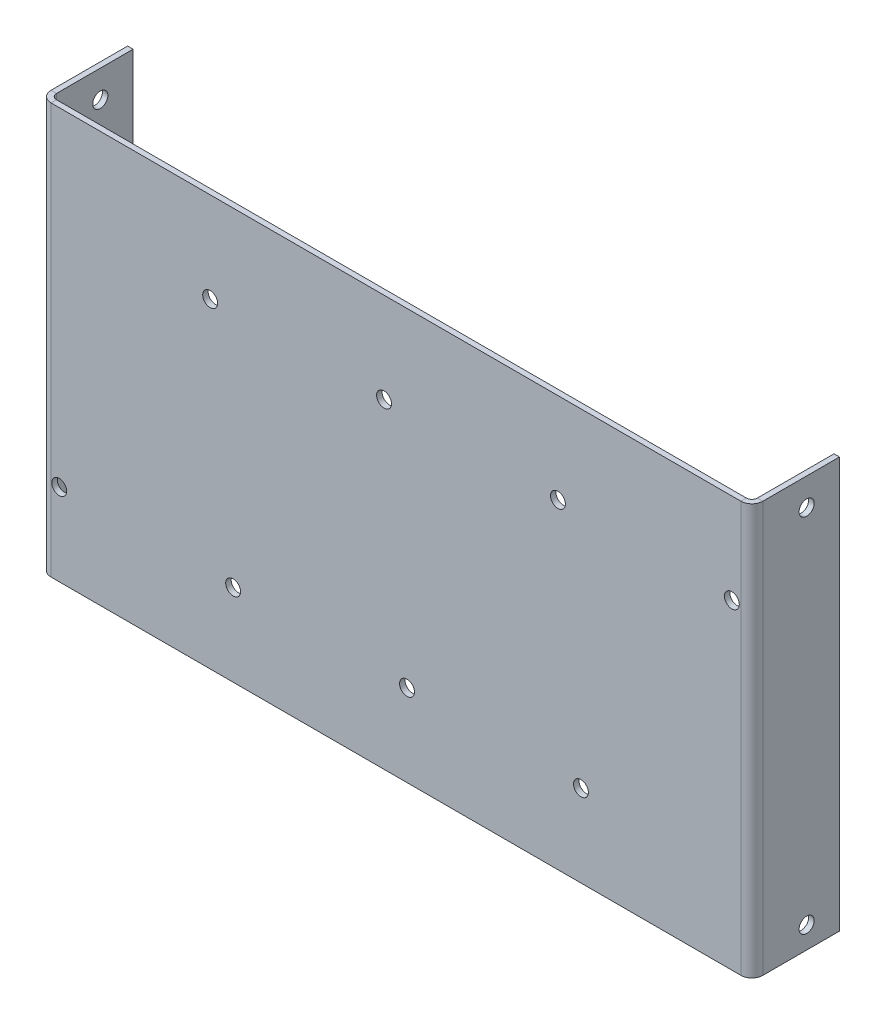
ISO-10303-21;
HEADER;
FILE_DESCRIPTION(('STEP AP214'),'2;1');
FILE_NAME('part.step','',(''),(''),'','','');
FILE_SCHEMA(('AUTOMOTIVE_DESIGN { 1 0 10303 214 1 1 1 1 }'));
ENDSEC;
DATA;
#1=APPLICATION_CONTEXT('core data for automotive mechanical design processes');
#2=APPLICATION_PROTOCOL_DEFINITION('international standard','automotive_design',2000,#1);
#3=PRODUCT_CONTEXT('',#1,'mechanical');
#4=PRODUCT('Part','Part','',(#3));
#5=PRODUCT_RELATED_PRODUCT_CATEGORY('part','',(#4));
#6=PRODUCT_DEFINITION_FORMATION('','',#4);
#7=PRODUCT_DEFINITION_CONTEXT('part definition',#1,'design');
#8=PRODUCT_DEFINITION('design','',#6,#7);
#9=PRODUCT_DEFINITION_SHAPE('','',#8);
#10=(LENGTH_UNIT() NAMED_UNIT(*) SI_UNIT(.MILLI.,.METRE.));
#11=(NAMED_UNIT(*) PLANE_ANGLE_UNIT() SI_UNIT($,.RADIAN.));
#12=(NAMED_UNIT(*) SI_UNIT($,.STERADIAN.) SOLID_ANGLE_UNIT());
#13=UNCERTAINTY_MEASURE_WITH_UNIT(LENGTH_MEASURE(1.E-05),#10,'distance_accuracy_value','');
#14=(GEOMETRIC_REPRESENTATION_CONTEXT(3) GLOBAL_UNCERTAINTY_ASSIGNED_CONTEXT((#13)) GLOBAL_UNIT_ASSIGNED_CONTEXT((#10,
#11,#12)) REPRESENTATION_CONTEXT('',''));
#15=CARTESIAN_POINT('',(0.,0.,0.));
#16=DIRECTION('',(0.,0.,1.));
#17=DIRECTION('',(1.,0.,0.));
#18=AXIS2_PLACEMENT_3D('',#15,#16,#17);
#19=CARTESIAN_POINT('',(-168.275,130.747339992382,0.));
#20=DIRECTION('',(0.,1.,0.));
#21=DIRECTION('',(-1.,0.,0.));
#22=AXIS2_PLACEMENT_3D('',#19,#20,#21);
#23=PLANE('',#22);
#24=DIRECTION('',(0.,0.,-1.));
#25=VECTOR('',#24,1.);
#26=CARTESIAN_POINT('',(-165.735,130.747339992382,0.));
#27=LINE('',#26,#25);
#28=CARTESIAN_POINT('',(-165.735,130.747339992382,1.27));
#29=VERTEX_POINT('',#28);
#30=CARTESIAN_POINT('',(-165.735,130.747339992382,0.));
#31=VERTEX_POINT('',#30);
#32=EDGE_CURVE('E11',#29,#31,#27,.T.);
#33=ORIENTED_EDGE('',*,*,#32,.F.);
#34=DIRECTION('',(1.,0.,0.));
#35=VECTOR('',#34,1.);
#36=CARTESIAN_POINT('',(0.,130.747339992382,1.27));
#37=LINE('',#36,#35);
#38=CARTESIAN_POINT('',(-5.715,130.747339992382,1.27));
#39=VERTEX_POINT('',#38);
#40=EDGE_CURVE('E149',#39,#29,#37,.F.);
#41=ORIENTED_EDGE('',*,*,#40,.F.);
#42=DIRECTION('',(0.,0.,-1.));
#43=VECTOR('',#42,1.);
#44=CARTESIAN_POINT('',(-5.715,130.747339992382,0.));
#45=LINE('',#44,#43);
#46=CARTESIAN_POINT('',(-5.715,130.747339992382,0.));
#47=VERTEX_POINT('',#46);
#48=EDGE_CURVE('E49',#39,#47,#45,.T.);
#49=ORIENTED_EDGE('',*,*,#48,.T.);
#50=DIRECTION('',(-1.,0.,0.));
#51=VECTOR('',#50,1.);
#52=CARTESIAN_POINT('',(-168.275,130.747339992382,0.));
#53=LINE('',#52,#51);
#54=EDGE_CURVE('E235',#47,#31,#53,.T.);
#55=ORIENTED_EDGE('',*,*,#54,.T.);
#56=EDGE_LOOP('',(#33,#41,#49,#55));
#57=FACE_BOUND('',#56,.T.);
#58=ADVANCED_FACE('F39',(#57),#23,.T.);
#59=CARTESIAN_POINT('',(-5.715,130.747339992382,-1.27));
#60=DIRECTION('',(0.,1.,0.));
#61=DIRECTION('',(0.,0.,1.));
#62=AXIS2_PLACEMENT_3D('',#59,#60,#61);
#63=PLANE('',#62);
#64=ORIENTED_EDGE('',*,*,#48,.F.);
#65=CARTESIAN_POINT('',(-5.715,130.747339992382,-1.27));
#66=DIRECTION('',(0.,-1.,0.));
#67=DIRECTION('',(1.,0.,0.));
#68=AXIS2_PLACEMENT_3D('',#65,#66,#67);
#69=CIRCLE('',#68,2.54);
#70=CARTESIAN_POINT('',(-3.175,130.747339992382,-1.27000000000001));
#71=VERTEX_POINT('',#70);
#72=EDGE_CURVE('E152',#39,#71,#69,.F.);
#73=ORIENTED_EDGE('',*,*,#72,.T.);
#74=DIRECTION('',(-1.,0.,0.));
#75=VECTOR('',#74,1.);
#76=CARTESIAN_POINT('',(-4.445,130.747339992382,-1.27000000000001));
#77=LINE('',#76,#75);
#78=CARTESIAN_POINT('',(-4.445,130.747339992382,-1.27000000000001));
#79=VERTEX_POINT('',#78);
#80=EDGE_CURVE('E186',#71,#79,#77,.T.);
#81=ORIENTED_EDGE('',*,*,#80,.T.);
#82=CARTESIAN_POINT('',(-5.715,130.747339992382,-1.27));
#83=DIRECTION('',(0.,-1.,0.));
#84=DIRECTION('',(0.,0.,-1.));
#85=AXIS2_PLACEMENT_3D('',#82,#83,#84);
#86=CIRCLE('',#85,1.27);
#87=EDGE_CURVE('E194',#47,#79,#86,.F.);
#88=ORIENTED_EDGE('',*,*,#87,.F.);
#89=EDGE_LOOP('',(#64,#73,#81,#88));
#90=FACE_BOUND('',#89,.T.);
#91=ADVANCED_FACE('F193',(#90),#63,.T.);
#92=CARTESIAN_POINT('',(-4.445,130.747339992382,-19.05));
#93=DIRECTION('',(0.,1.,0.));
#94=DIRECTION('',(0.,0.,1.));
#95=AXIS2_PLACEMENT_3D('',#92,#93,#94);
#96=PLANE('',#95);
#97=ORIENTED_EDGE('',*,*,#80,.F.);
#98=DIRECTION('',(0.,0.,1.));
#99=VECTOR('',#98,1.);
#100=CARTESIAN_POINT('',(-3.175,130.747339992382,-19.05));
#101=LINE('',#100,#99);
#102=CARTESIAN_POINT('',(-3.175,130.747339992382,-19.05));
#103=VERTEX_POINT('',#102);
#104=EDGE_CURVE('E130',#103,#71,#101,.T.);
#105=ORIENTED_EDGE('',*,*,#104,.F.);
#106=DIRECTION('',(-1.,0.,0.));
#107=VECTOR('',#106,1.);
#108=CARTESIAN_POINT('',(-4.445,130.747339992382,-19.05));
#109=LINE('',#108,#107);
#110=CARTESIAN_POINT('',(-4.445,130.747339992382,-19.05));
#111=VERTEX_POINT('',#110);
#112=EDGE_CURVE('E183',#103,#111,#109,.T.);
#113=ORIENTED_EDGE('',*,*,#112,.T.);
#114=DIRECTION('',(0.,0.,1.));
#115=VECTOR('',#114,1.);
#116=CARTESIAN_POINT('',(-4.445,130.747339992382,-19.05));
#117=LINE('',#116,#115);
#118=EDGE_CURVE('E214',#111,#79,#117,.T.);
#119=ORIENTED_EDGE('',*,*,#118,.T.);
#120=EDGE_LOOP('',(#97,#105,#113,#119));
#121=FACE_BOUND('',#120,.T.);
#122=ADVANCED_FACE('F215',(#121),#96,.T.);
#123=CARTESIAN_POINT('',(-4.445,130.747339992382,-19.05));
#124=DIRECTION('',(0.,0.,-1.));
#125=DIRECTION('',(0.,1.,0.));
#126=AXIS2_PLACEMENT_3D('',#123,#124,#125);
#127=PLANE('',#126);
#128=ORIENTED_EDGE('',*,*,#112,.F.);
#129=DIRECTION('',(0.,1.,0.));
#130=VECTOR('',#129,1.);
#131=CARTESIAN_POINT('',(-3.175,130.747339992382,-19.05));
#132=LINE('',#131,#130);
#133=CARTESIAN_POINT('',(-3.175,35.4973399923822,-19.05));
#134=VERTEX_POINT('',#133);
#135=EDGE_CURVE('E156',#134,#103,#132,.T.);
#136=ORIENTED_EDGE('',*,*,#135,.F.);
#137=DIRECTION('',(-1.,0.,0.));
#138=VECTOR('',#137,1.);
#139=CARTESIAN_POINT('',(-4.445,35.4973399923822,-19.05));
#140=LINE('',#139,#138);
#141=CARTESIAN_POINT('',(-4.445,35.4973399923822,-19.05));
#142=VERTEX_POINT('',#141);
#143=EDGE_CURVE('E180',#134,#142,#140,.T.);
#144=ORIENTED_EDGE('',*,*,#143,.T.);
#145=DIRECTION('',(0.,1.,0.));
#146=VECTOR('',#145,1.);
#147=CARTESIAN_POINT('',(-4.445,130.747339992382,-19.05));
#148=LINE('',#147,#146);
#149=EDGE_CURVE('E219',#142,#111,#148,.T.);
#150=ORIENTED_EDGE('',*,*,#149,.T.);
#151=EDGE_LOOP('',(#128,#136,#144,#150));
#152=FACE_BOUND('',#151,.T.);
#153=ADVANCED_FACE('F272',(#152),#127,.T.);
#154=CARTESIAN_POINT('',(-4.445,35.4973399923822,-19.05));
#155=DIRECTION('',(0.,1.,0.));
#156=DIRECTION('',(0.,0.,1.));
#157=AXIS2_PLACEMENT_3D('',#154,#155,#156);
#158=PLANE('',#157);
#159=ORIENTED_EDGE('',*,*,#143,.F.);
#160=DIRECTION('',(0.,0.,1.));
#161=VECTOR('',#160,1.);
#162=CARTESIAN_POINT('',(-3.175,35.4973399923822,-19.05));
#163=LINE('',#162,#161);
#164=CARTESIAN_POINT('',(-3.175,35.4973399923822,-1.27000000000001));
#165=VERTEX_POINT('',#164);
#166=EDGE_CURVE('E153',#134,#165,#163,.T.);
#167=ORIENTED_EDGE('',*,*,#166,.T.);
#168=DIRECTION('',(-1.,0.,0.));
#169=VECTOR('',#168,1.);
#170=CARTESIAN_POINT('',(-4.445,35.4973399923822,-1.27000000000001));
#171=LINE('',#170,#169);
#172=CARTESIAN_POINT('',(-4.445,35.4973399923822,-1.27000000000001));
#173=VERTEX_POINT('',#172);
#174=EDGE_CURVE('E177',#165,#173,#171,.T.);
#175=ORIENTED_EDGE('',*,*,#174,.T.);
#176=DIRECTION('',(0.,0.,1.));
#177=VECTOR('',#176,1.);
#178=CARTESIAN_POINT('',(-4.445,35.4973399923822,-19.05));
#179=LINE('',#178,#177);
#180=EDGE_CURVE('E224',#142,#173,#179,.T.);
#181=ORIENTED_EDGE('',*,*,#180,.F.);
#182=EDGE_LOOP('',(#159,#167,#175,#181));
#183=FACE_BOUND('',#182,.T.);
#184=ADVANCED_FACE('F392',(#183),#158,.F.);
#185=CARTESIAN_POINT('',(-5.71500000000001,35.4973399923822,-1.27));
#186=DIRECTION('',(0.,1.,0.));
#187=DIRECTION('',(0.,0.,1.));
#188=AXIS2_PLACEMENT_3D('',#185,#186,#187);
#189=PLANE('',#188);
#190=ORIENTED_EDGE('',*,*,#174,.F.);
#191=CARTESIAN_POINT('',(-5.71500000000001,35.4973399923822,-1.27));
#192=DIRECTION('',(0.,-1.,0.));
#193=DIRECTION('',(1.,0.,0.));
#194=AXIS2_PLACEMENT_3D('',#191,#192,#193);
#195=CIRCLE('',#194,2.54);
#196=CARTESIAN_POINT('',(-5.71499999999999,35.4973399923822,1.27));
#197=VERTEX_POINT('',#196);
#198=EDGE_CURVE('E146',#165,#197,#195,.T.);
#199=ORIENTED_EDGE('',*,*,#198,.T.);
#200=DIRECTION('',(0.,0.,-1.));
#201=VECTOR('',#200,1.);
#202=CARTESIAN_POINT('',(-5.715,35.4973399923822,0.));
#203=LINE('',#202,#201);
#204=CARTESIAN_POINT('',(-5.715,35.4973399923822,0.));
#205=VERTEX_POINT('',#204);
#206=EDGE_CURVE('E175',#197,#205,#203,.T.);
#207=ORIENTED_EDGE('',*,*,#206,.T.);
#208=CARTESIAN_POINT('',(-5.71500000000001,35.4973399923822,-1.27));
#209=DIRECTION('',(0.,-1.,0.));
#210=DIRECTION('',(0.,0.,-1.));
#211=AXIS2_PLACEMENT_3D('',#208,#209,#210);
#212=CIRCLE('',#211,1.27);
#213=EDGE_CURVE('E210',#173,#205,#212,.T.);
#214=ORIENTED_EDGE('',*,*,#213,.F.);
#215=EDGE_LOOP('',(#190,#199,#207,#214));
#216=FACE_BOUND('',#215,.T.);
#217=ADVANCED_FACE('F395',(#216),#189,.F.);
#218=CARTESIAN_POINT('',(-168.275,35.4973399923822,0.));
#219=DIRECTION('',(0.,-1.,0.));
#220=DIRECTION('',(1.,0.,0.));
#221=AXIS2_PLACEMENT_3D('',#218,#219,#220);
#222=PLANE('',#221);
#223=ORIENTED_EDGE('',*,*,#206,.F.);
#224=DIRECTION('',(1.,0.,0.));
#225=VECTOR('',#224,1.);
#226=CARTESIAN_POINT('',(0.,35.4973399923822,1.27));
#227=LINE('',#226,#225);
#228=CARTESIAN_POINT('',(-165.735,35.4973399923822,1.27));
#229=VERTEX_POINT('',#228);
#230=EDGE_CURVE('E144',#229,#197,#227,.T.);
#231=ORIENTED_EDGE('',*,*,#230,.F.);
#232=DIRECTION('',(0.,0.,-1.));
#233=VECTOR('',#232,1.);
#234=CARTESIAN_POINT('',(-165.735,35.4973399923822,0.));
#235=LINE('',#234,#233);
#236=CARTESIAN_POINT('',(-165.735,35.4973399923822,0.));
#237=VERTEX_POINT('',#236);
#238=EDGE_CURVE('E172',#229,#237,#235,.T.);
#239=ORIENTED_EDGE('',*,*,#238,.T.);
#240=DIRECTION('',(1.,0.,0.));
#241=VECTOR('',#240,1.);
#242=CARTESIAN_POINT('',(-168.275,35.4973399923822,0.));
#243=LINE('',#242,#241);
#244=EDGE_CURVE('E237',#237,#205,#243,.T.);
#245=ORIENTED_EDGE('',*,*,#244,.T.);
#246=EDGE_LOOP('',(#223,#231,#239,#245));
#247=FACE_BOUND('',#246,.T.);
#248=ADVANCED_FACE('F399',(#247),#222,.T.);
#249=CARTESIAN_POINT('',(-165.735,35.4973399923822,-1.27));
#250=DIRECTION('',(0.,-1.,0.));
#251=DIRECTION('',(0.,0.,-1.));
#252=AXIS2_PLACEMENT_3D('',#249,#250,#251);
#253=PLANE('',#252);
#254=ORIENTED_EDGE('',*,*,#238,.F.);
#255=CARTESIAN_POINT('',(-165.735,35.4973399923822,-1.27));
#256=DIRECTION('',(0.,1.,0.));
#257=DIRECTION('',(0.,0.,1.));
#258=AXIS2_PLACEMENT_3D('',#255,#256,#257);
#259=CIRCLE('',#258,2.54);
#260=CARTESIAN_POINT('',(-168.275,35.4973399923822,-1.27000000000001));
#261=VERTEX_POINT('',#260);
#262=EDGE_CURVE('E131',#229,#261,#259,.F.);
#263=ORIENTED_EDGE('',*,*,#262,.T.);
#264=DIRECTION('',(1.,0.,0.));
#265=VECTOR('',#264,1.);
#266=CARTESIAN_POINT('',(-167.005,35.4973399923822,-1.27000000000001));
#267=LINE('',#266,#265);
#268=CARTESIAN_POINT('',(-167.005,35.4973399923822,-1.27000000000001));
#269=VERTEX_POINT('',#268);
#270=EDGE_CURVE('E169',#261,#269,#267,.T.);
#271=ORIENTED_EDGE('',*,*,#270,.T.);
#272=CARTESIAN_POINT('',(-165.735,35.4973399923822,-1.27));
#273=DIRECTION('',(0.,1.,0.));
#274=DIRECTION('',(0.,0.,1.));
#275=AXIS2_PLACEMENT_3D('',#272,#273,#274);
#276=CIRCLE('',#275,1.27);
#277=EDGE_CURVE('E251',#237,#269,#276,.F.);
#278=ORIENTED_EDGE('',*,*,#277,.F.);
#279=EDGE_LOOP('',(#254,#263,#271,#278));
#280=FACE_BOUND('',#279,.T.);
#281=ADVANCED_FACE('F403',(#280),#253,.T.);
#282=CARTESIAN_POINT('',(-167.005,35.4973399923822,-19.05));
#283=DIRECTION('',(0.,-1.,0.));
#284=DIRECTION('',(0.,0.,1.));
#285=AXIS2_PLACEMENT_3D('',#282,#283,#284);
#286=PLANE('',#285);
#287=ORIENTED_EDGE('',*,*,#270,.F.);
#288=DIRECTION('',(0.,0.,1.));
#289=VECTOR('',#288,1.);
#290=CARTESIAN_POINT('',(-168.275,35.4973399923822,-19.05));
#291=LINE('',#290,#289);
#292=CARTESIAN_POINT('',(-168.275,35.4973399923822,-19.05));
#293=VERTEX_POINT('',#292);
#294=EDGE_CURVE('E121',#293,#261,#291,.T.);
#295=ORIENTED_EDGE('',*,*,#294,.F.);
#296=DIRECTION('',(1.,0.,0.));
#297=VECTOR('',#296,1.);
#298=CARTESIAN_POINT('',(-167.005,35.4973399923822,-19.05));
#299=LINE('',#298,#297);
#300=CARTESIAN_POINT('',(-167.005,35.4973399923822,-19.05));
#301=VERTEX_POINT('',#300);
#302=EDGE_CURVE('E166',#293,#301,#299,.T.);
#303=ORIENTED_EDGE('',*,*,#302,.T.);
#304=DIRECTION('',(0.,0.,1.));
#305=VECTOR('',#304,1.);
#306=CARTESIAN_POINT('',(-167.005,35.4973399923822,-19.05));
#307=LINE('',#306,#305);
#308=EDGE_CURVE('E245',#301,#269,#307,.T.);
#309=ORIENTED_EDGE('',*,*,#308,.T.);
#310=EDGE_LOOP('',(#287,#295,#303,#309));
#311=FACE_BOUND('',#310,.T.);
#312=ADVANCED_FACE('F407',(#311),#286,.T.);
#313=CARTESIAN_POINT('',(-167.005,130.747339992382,-19.05));
#314=DIRECTION('',(0.,0.,-1.));
#315=DIRECTION('',(0.,-1.,0.));
#316=AXIS2_PLACEMENT_3D('',#313,#314,#315);
#317=PLANE('',#316);
#318=ORIENTED_EDGE('',*,*,#302,.F.);
#319=DIRECTION('',(0.,1.,0.));
#320=VECTOR('',#319,1.);
#321=CARTESIAN_POINT('',(-168.275,130.747339992382,-19.05));
#322=LINE('',#321,#320);
#323=CARTESIAN_POINT('',(-168.275,130.747339992382,-19.05));
#324=VERTEX_POINT('',#323);
#325=EDGE_CURVE('E136',#324,#293,#322,.F.);
#326=ORIENTED_EDGE('',*,*,#325,.F.);
#327=DIRECTION('',(1.,0.,0.));
#328=VECTOR('',#327,1.);
#329=CARTESIAN_POINT('',(-167.005,130.747339992382,-19.05));
#330=LINE('',#329,#328);
#331=CARTESIAN_POINT('',(-167.005,130.747339992382,-19.05));
#332=VERTEX_POINT('',#331);
#333=EDGE_CURVE('E110',#324,#332,#330,.T.);
#334=ORIENTED_EDGE('',*,*,#333,.T.);
#335=DIRECTION('',(0.,-1.,0.));
#336=VECTOR('',#335,1.);
#337=CARTESIAN_POINT('',(-167.005,130.747339992382,-19.05));
#338=LINE('',#337,#336);
#339=EDGE_CURVE('E498',#332,#301,#338,.T.);
#340=ORIENTED_EDGE('',*,*,#339,.T.);
#341=EDGE_LOOP('',(#318,#326,#334,#340));
#342=FACE_BOUND('',#341,.T.);
#343=ADVANCED_FACE('F411',(#342),#317,.T.);
#344=CARTESIAN_POINT('',(-167.005,130.747339992382,-19.05));
#345=DIRECTION('',(0.,-1.,0.));
#346=DIRECTION('',(0.,0.,1.));
#347=AXIS2_PLACEMENT_3D('',#344,#345,#346);
#348=PLANE('',#347);
#349=ORIENTED_EDGE('',*,*,#333,.F.);
#350=DIRECTION('',(0.,0.,1.));
#351=VECTOR('',#350,1.);
#352=CARTESIAN_POINT('',(-168.275,130.747339992382,-19.05));
#353=LINE('',#352,#351);
#354=CARTESIAN_POINT('',(-168.275,130.747339992382,-1.27000000000001));
#355=VERTEX_POINT('',#354);
#356=EDGE_CURVE('E119',#324,#355,#353,.T.);
#357=ORIENTED_EDGE('',*,*,#356,.T.);
#358=DIRECTION('',(1.,0.,0.));
#359=VECTOR('',#358,1.);
#360=CARTESIAN_POINT('',(-167.005,130.747339992382,-1.27000000000001));
#361=LINE('',#360,#359);
#362=CARTESIAN_POINT('',(-167.005,130.747339992382,-1.27000000000001));
#363=VERTEX_POINT('',#362);
#364=EDGE_CURVE('E43',#355,#363,#361,.T.);
#365=ORIENTED_EDGE('',*,*,#364,.T.);
#366=DIRECTION('',(0.,0.,1.));
#367=VECTOR('',#366,1.);
#368=CARTESIAN_POINT('',(-167.005,130.747339992382,-19.05));
#369=LINE('',#368,#367);
#370=EDGE_CURVE('E497',#332,#363,#369,.T.);
#371=ORIENTED_EDGE('',*,*,#370,.F.);
#372=EDGE_LOOP('',(#349,#357,#365,#371));
#373=FACE_BOUND('',#372,.T.);
#374=ADVANCED_FACE('F133',(#373),#348,.F.);
#375=CARTESIAN_POINT('',(-165.735,130.747339992382,-1.27));
#376=DIRECTION('',(0.,-1.,0.));
#377=DIRECTION('',(0.,0.,-1.));
#378=AXIS2_PLACEMENT_3D('',#375,#376,#377);
#379=PLANE('',#378);
#380=CARTESIAN_POINT('',(-165.735,130.747339992382,-1.27));
#381=DIRECTION('',(0.,1.,0.));
#382=DIRECTION('',(0.,0.,1.));
#383=AXIS2_PLACEMENT_3D('',#380,#381,#382);
#384=CIRCLE('',#383,2.54);
#385=EDGE_CURVE('E102',#355,#29,#384,.T.);
#386=ORIENTED_EDGE('',*,*,#385,.T.);
#387=ORIENTED_EDGE('',*,*,#32,.T.);
#388=CARTESIAN_POINT('',(-165.735,130.747339992382,-1.27));
#389=DIRECTION('',(0.,1.,0.));
#390=DIRECTION('',(0.,0.,1.));
#391=AXIS2_PLACEMENT_3D('',#388,#389,#390);
#392=CIRCLE('',#391,1.27);
#393=EDGE_CURVE('E105',#363,#31,#392,.T.);
#394=ORIENTED_EDGE('',*,*,#393,.F.);
#395=ORIENTED_EDGE('',*,*,#364,.F.);
#396=EDGE_LOOP('',(#386,#387,#394,#395));
#397=FACE_BOUND('',#396,.T.);
#398=ADVANCED_FACE('F41',(#397),#379,.F.);
#399=CARTESIAN_POINT('',(-167.005,130.747339992382,-19.05));
#400=DIRECTION('',(-1.,0.,0.));
#401=DIRECTION('',(0.,0.,1.));
#402=AXIS2_PLACEMENT_3D('',#399,#400,#401);
#403=PLANE('',#402);
#404=CARTESIAN_POINT('',(-167.005,124.397339992382,-11.43));
#405=DIRECTION('',(-1.,0.,0.));
#406=DIRECTION('',(0.,0.,1.));
#407=AXIS2_PLACEMENT_3D('',#404,#405,#406);
#408=CIRCLE('',#407,1.7526);
#409=CARTESIAN_POINT('',(-167.005,124.397339992382,-9.67740000000001));
#410=VERTEX_POINT('',#409);
#411=EDGE_CURVE('E336',#410,#410,#408,.T.);
#412=ORIENTED_EDGE('',*,*,#411,.T.);
#413=EDGE_LOOP('',(#412));
#414=FACE_BOUND('',#413,.T.);
#415=CARTESIAN_POINT('',(-167.005,40.5773399923822,-11.43));
#416=DIRECTION('',(-1.,0.,0.));
#417=DIRECTION('',(0.,0.,1.));
#418=AXIS2_PLACEMENT_3D('',#415,#416,#417);
#419=CIRCLE('',#418,1.7526);
#420=CARTESIAN_POINT('',(-167.005,40.5773399923822,-9.6774));
#421=VERTEX_POINT('',#420);
#422=EDGE_CURVE('E326',#421,#421,#419,.T.);
#423=ORIENTED_EDGE('',*,*,#422,.T.);
#424=EDGE_LOOP('',(#423));
#425=FACE_BOUND('',#424,.T.);
#426=ORIENTED_EDGE('',*,*,#370,.T.);
#427=DIRECTION('',(0.,-1.,0.));
#428=VECTOR('',#427,1.);
#429=CARTESIAN_POINT('',(-167.005,35.4973399923822,-1.27));
#430=LINE('',#429,#428);
#431=EDGE_CURVE('E230',#363,#269,#430,.T.);
#432=ORIENTED_EDGE('',*,*,#431,.T.);
#433=ORIENTED_EDGE('',*,*,#308,.F.);
#434=ORIENTED_EDGE('',*,*,#339,.F.);
#435=EDGE_LOOP('',(#426,#432,#433,#434));
#436=FACE_BOUND('',#435,.T.);
#437=ADVANCED_FACE('F436',(#414,#425,#436),#403,.F.);
#438=CARTESIAN_POINT('',(0.,0.,0.));
#439=DIRECTION('',(0.,0.,1.));
#440=DIRECTION('',(1.,0.,0.));
#441=AXIS2_PLACEMENT_3D('',#438,#439,#440);
#442=PLANE('',#441);
#443=CARTESIAN_POINT('',(-42.8244,54.5473399923822,0.));
#444=DIRECTION('',(0.,0.,1.));
#445=DIRECTION('',(1.,0.,0.));
#446=AXIS2_PLACEMENT_3D('',#443,#444,#445);
#447=CIRCLE('',#446,1.72720000000001);
#448=CARTESIAN_POINT('',(-41.0972,54.5473399923822,0.));
#449=VERTEX_POINT('',#448);
#450=EDGE_CURVE('E320',#449,#449,#447,.T.);
#451=ORIENTED_EDGE('',*,*,#450,.T.);
#452=EDGE_LOOP('',(#451));
#453=FACE_BOUND('',#452,.T.);
#454=CARTESIAN_POINT('',(-83.1596,54.5473399923822,0.));
#455=DIRECTION('',(0.,0.,1.));
#456=DIRECTION('',(1.,0.,0.));
#457=AXIS2_PLACEMENT_3D('',#454,#455,#456);
#458=CIRCLE('',#457,1.7272);
#459=CARTESIAN_POINT('',(-81.4324,54.5473399923822,0.));
#460=VERTEX_POINT('',#459);
#461=EDGE_CURVE('E314',#460,#460,#458,.T.);
#462=ORIENTED_EDGE('',*,*,#461,.T.);
#463=EDGE_LOOP('',(#462));
#464=FACE_BOUND('',#463,.T.);
#465=CARTESIAN_POINT('',(-123.4948,54.5473399923822,0.));
#466=DIRECTION('',(0.,0.,1.));
#467=DIRECTION('',(1.,0.,0.));
#468=AXIS2_PLACEMENT_3D('',#465,#466,#467);
#469=CIRCLE('',#468,1.7272);
#470=CARTESIAN_POINT('',(-121.7676,54.5473399923822,0.));
#471=VERTEX_POINT('',#470);
#472=EDGE_CURVE('E308',#471,#471,#469,.T.);
#473=ORIENTED_EDGE('',*,*,#472,.T.);
#474=EDGE_LOOP('',(#473));
#475=FACE_BOUND('',#474,.T.);
#476=CARTESIAN_POINT('',(-163.83,54.5473399923822,0.));
#477=DIRECTION('',(0.,0.,1.));
#478=DIRECTION('',(1.,0.,0.));
#479=AXIS2_PLACEMENT_3D('',#476,#477,#478);
#480=CIRCLE('',#479,1.7272);
#481=CARTESIAN_POINT('',(-162.1028,54.5473399923822,0.));
#482=VERTEX_POINT('',#481);
#483=EDGE_CURVE('E302',#482,#482,#480,.T.);
#484=ORIENTED_EDGE('',*,*,#483,.T.);
#485=EDGE_LOOP('',(#484));
#486=FACE_BOUND('',#485,.T.);
#487=CARTESIAN_POINT('',(-128.8288,109.792339992382,0.));
#488=DIRECTION('',(0.,0.,1.));
#489=DIRECTION('',(1.,0.,0.));
#490=AXIS2_PLACEMENT_3D('',#487,#488,#489);
#491=CIRCLE('',#490,1.7272);
#492=CARTESIAN_POINT('',(-127.1016,109.792339992382,0.));
#493=VERTEX_POINT('',#492);
#494=EDGE_CURVE('E296',#493,#493,#491,.T.);
#495=ORIENTED_EDGE('',*,*,#494,.T.);
#496=EDGE_LOOP('',(#495));
#497=FACE_BOUND('',#496,.T.);
#498=CARTESIAN_POINT('',(-88.4936,109.792339992382,0.));
#499=DIRECTION('',(0.,0.,1.));
#500=DIRECTION('',(1.,0.,0.));
#501=AXIS2_PLACEMENT_3D('',#498,#499,#500);
#502=CIRCLE('',#501,1.7272);
#503=CARTESIAN_POINT('',(-86.7664,109.792339992382,0.));
#504=VERTEX_POINT('',#503);
#505=EDGE_CURVE('E290',#504,#504,#502,.T.);
#506=ORIENTED_EDGE('',*,*,#505,.T.);
#507=EDGE_LOOP('',(#506));
#508=FACE_BOUND('',#507,.T.);
#509=CARTESIAN_POINT('',(-48.1584,109.792339992382,0.));
#510=DIRECTION('',(0.,0.,1.));
#511=DIRECTION('',(1.,0.,0.));
#512=AXIS2_PLACEMENT_3D('',#509,#510,#511);
#513=CIRCLE('',#512,1.7272);
#514=CARTESIAN_POINT('',(-46.4312,109.792339992382,0.));
#515=VERTEX_POINT('',#514);
#516=EDGE_CURVE('E284',#515,#515,#513,.T.);
#517=ORIENTED_EDGE('',*,*,#516,.T.);
#518=EDGE_LOOP('',(#517));
#519=FACE_BOUND('',#518,.T.);
#520=CARTESIAN_POINT('',(-7.82320000000002,109.792339992382,0.));
#521=DIRECTION('',(0.,0.,1.));
#522=DIRECTION('',(1.,0.,0.));
#523=AXIS2_PLACEMENT_3D('',#520,#521,#522);
#524=CIRCLE('',#523,1.72719999999999);
#525=CARTESIAN_POINT('',(-6.09600000000003,109.792339992382,0.));
#526=VERTEX_POINT('',#525);
#527=EDGE_CURVE('E163',#526,#526,#524,.T.);
#528=ORIENTED_EDGE('',*,*,#527,.T.);
#529=EDGE_LOOP('',(#528));
#530=FACE_BOUND('',#529,.T.);
#531=ORIENTED_EDGE('',*,*,#54,.F.);
#532=DIRECTION('',(0.,1.,0.));
#533=VECTOR('',#532,1.);
#534=CARTESIAN_POINT('',(-5.71500000000001,35.4973399923822,0.));
#535=LINE('',#534,#533);
#536=EDGE_CURVE('E111',#47,#205,#535,.F.);
#537=ORIENTED_EDGE('',*,*,#536,.T.);
#538=ORIENTED_EDGE('',*,*,#244,.F.);
#539=DIRECTION('',(0.,-1.,0.));
#540=VECTOR('',#539,1.);
#541=CARTESIAN_POINT('',(-165.735,130.747339992382,0.));
#542=LINE('',#541,#540);
#543=EDGE_CURVE('E226',#237,#31,#542,.F.);
#544=ORIENTED_EDGE('',*,*,#543,.T.);
#545=EDGE_LOOP('',(#531,#537,#538,#544));
#546=FACE_BOUND('',#545,.T.);
#547=ADVANCED_FACE('F364',(#453,#464,#475,#486,#497,#508,#519,#530,#546),#442,.F.);
#548=CARTESIAN_POINT('',(-4.445,130.747339992382,-19.05));
#549=DIRECTION('',(1.,0.,0.));
#550=DIRECTION('',(0.,1.,0.));
#551=AXIS2_PLACEMENT_3D('',#548,#549,#550);
#552=PLANE('',#551);
#553=CARTESIAN_POINT('',(-4.445,124.397339992382,-11.43));
#554=DIRECTION('',(1.,0.,0.));
#555=DIRECTION('',(0.,1.,0.));
#556=AXIS2_PLACEMENT_3D('',#553,#554,#555);
#557=CIRCLE('',#556,1.7526);
#558=CARTESIAN_POINT('',(-4.445,126.149939992382,-11.43));
#559=VERTEX_POINT('',#558);
#560=EDGE_CURVE('E341',#559,#559,#557,.T.);
#561=ORIENTED_EDGE('',*,*,#560,.T.);
#562=EDGE_LOOP('',(#561));
#563=FACE_BOUND('',#562,.T.);
#564=CARTESIAN_POINT('',(-4.445,40.5773399923822,-11.43));
#565=DIRECTION('',(1.,0.,0.));
#566=DIRECTION('',(0.,1.,0.));
#567=AXIS2_PLACEMENT_3D('',#564,#565,#566);
#568=CIRCLE('',#567,1.7526);
#569=CARTESIAN_POINT('',(-4.445,42.3299399923822,-11.43));
#570=VERTEX_POINT('',#569);
#571=EDGE_CURVE('E329',#570,#570,#568,.T.);
#572=ORIENTED_EDGE('',*,*,#571,.T.);
#573=EDGE_LOOP('',(#572));
#574=FACE_BOUND('',#573,.T.);
#575=ORIENTED_EDGE('',*,*,#180,.T.);
#576=DIRECTION('',(0.,1.,0.));
#577=VECTOR('',#576,1.);
#578=CARTESIAN_POINT('',(-4.445,130.747339992382,-1.27));
#579=LINE('',#578,#577);
#580=EDGE_CURVE('E208',#173,#79,#579,.T.);
#581=ORIENTED_EDGE('',*,*,#580,.T.);
#582=ORIENTED_EDGE('',*,*,#118,.F.);
#583=ORIENTED_EDGE('',*,*,#149,.F.);
#584=EDGE_LOOP('',(#575,#581,#582,#583));
#585=FACE_BOUND('',#584,.T.);
#586=ADVANCED_FACE('F222',(#563,#574,#585),#552,.F.);
#587=CARTESIAN_POINT('',(-165.735,130.747339992382,-1.27));
#588=DIRECTION('',(0.,1.,0.));
#589=DIRECTION('',(0.,0.,1.));
#590=AXIS2_PLACEMENT_3D('',#587,#588,#589);
#591=CYLINDRICAL_SURFACE('',#590,1.27);
#592=ORIENTED_EDGE('',*,*,#393,.T.);
#593=ORIENTED_EDGE('',*,*,#543,.F.);
#594=ORIENTED_EDGE('',*,*,#277,.T.);
#595=ORIENTED_EDGE('',*,*,#431,.F.);
#596=EDGE_LOOP('',(#592,#593,#594,#595));
#597=FACE_BOUND('',#596,.T.);
#598=ADVANCED_FACE('F363',(#597),#591,.F.);
#599=CARTESIAN_POINT('',(-5.715,130.747339992382,-1.27));
#600=DIRECTION('',(0.,-1.,0.));
#601=DIRECTION('',(1.,0.,0.));
#602=AXIS2_PLACEMENT_3D('',#599,#600,#601);
#603=CYLINDRICAL_SURFACE('',#602,1.27);
#604=ORIENTED_EDGE('',*,*,#213,.T.);
#605=ORIENTED_EDGE('',*,*,#536,.F.);
#606=ORIENTED_EDGE('',*,*,#87,.T.);
#607=ORIENTED_EDGE('',*,*,#580,.F.);
#608=EDGE_LOOP('',(#604,#605,#606,#607));
#609=FACE_BOUND('',#608,.T.);
#610=ADVANCED_FACE('F206',(#609),#603,.F.);
#611=CARTESIAN_POINT('',(-168.275,130.747339992382,-19.05));
#612=DIRECTION('',(-1.,0.,0.));
#613=DIRECTION('',(0.,0.,1.));
#614=AXIS2_PLACEMENT_3D('',#611,#612,#613);
#615=PLANE('',#614);
#616=CARTESIAN_POINT('',(-168.275,124.397339992382,-11.43));
#617=DIRECTION('',(-1.,0.,0.));
#618=DIRECTION('',(0.,0.,1.));
#619=AXIS2_PLACEMENT_3D('',#616,#617,#618);
#620=CIRCLE('',#619,1.7526);
#621=CARTESIAN_POINT('',(-168.275,124.397339992382,-9.67740000000001));
#622=VERTEX_POINT('',#621);
#623=EDGE_CURVE('E345',#622,#622,#620,.T.);
#624=ORIENTED_EDGE('',*,*,#623,.F.);
#625=EDGE_LOOP('',(#624));
#626=FACE_BOUND('',#625,.T.);
#627=CARTESIAN_POINT('',(-168.275,40.5773399923822,-11.43));
#628=DIRECTION('',(-1.,0.,0.));
#629=DIRECTION('',(0.,0.,1.));
#630=AXIS2_PLACEMENT_3D('',#627,#628,#629);
#631=CIRCLE('',#630,1.7526);
#632=CARTESIAN_POINT('',(-168.275,40.5773399923822,-9.6774));
#633=VERTEX_POINT('',#632);
#634=EDGE_CURVE('E333',#633,#633,#631,.T.);
#635=ORIENTED_EDGE('',*,*,#634,.F.);
#636=EDGE_LOOP('',(#635));
#637=FACE_BOUND('',#636,.T.);
#638=ORIENTED_EDGE('',*,*,#356,.F.);
#639=ORIENTED_EDGE('',*,*,#325,.T.);
#640=ORIENTED_EDGE('',*,*,#294,.T.);
#641=DIRECTION('',(0.,1.,0.));
#642=VECTOR('',#641,1.);
#643=CARTESIAN_POINT('',(-168.275,130.747339992382,-1.27000000000001));
#644=LINE('',#643,#642);
#645=EDGE_CURVE('E116',#355,#261,#644,.F.);
#646=ORIENTED_EDGE('',*,*,#645,.F.);
#647=EDGE_LOOP('',(#638,#639,#640,#646));
#648=FACE_BOUND('',#647,.T.);
#649=ADVANCED_FACE('F117',(#626,#637,#648),#615,.T.);
#650=CARTESIAN_POINT('',(0.,0.,1.27));
#651=DIRECTION('',(0.,0.,1.));
#652=DIRECTION('',(1.,0.,0.));
#653=AXIS2_PLACEMENT_3D('',#650,#651,#652);
#654=PLANE('',#653);
#655=CARTESIAN_POINT('',(-42.8244,54.5473399923822,1.27));
#656=DIRECTION('',(0.,0.,1.));
#657=DIRECTION('',(1.,0.,0.));
#658=AXIS2_PLACEMENT_3D('',#655,#656,#657);
#659=CIRCLE('',#658,1.72720000000001);
#660=CARTESIAN_POINT('',(-41.0972,54.5473399923822,1.27));
#661=VERTEX_POINT('',#660);
#662=EDGE_CURVE('E323',#661,#661,#659,.T.);
#663=ORIENTED_EDGE('',*,*,#662,.F.);
#664=EDGE_LOOP('',(#663));
#665=FACE_BOUND('',#664,.T.);
#666=CARTESIAN_POINT('',(-83.1596,54.5473399923822,1.27));
#667=DIRECTION('',(0.,0.,1.));
#668=DIRECTION('',(1.,0.,0.));
#669=AXIS2_PLACEMENT_3D('',#666,#667,#668);
#670=CIRCLE('',#669,1.7272);
#671=CARTESIAN_POINT('',(-81.4324,54.5473399923822,1.27));
#672=VERTEX_POINT('',#671);
#673=EDGE_CURVE('E317',#672,#672,#670,.T.);
#674=ORIENTED_EDGE('',*,*,#673,.F.);
#675=EDGE_LOOP('',(#674));
#676=FACE_BOUND('',#675,.T.);
#677=CARTESIAN_POINT('',(-123.4948,54.5473399923822,1.27));
#678=DIRECTION('',(0.,0.,1.));
#679=DIRECTION('',(1.,0.,0.));
#680=AXIS2_PLACEMENT_3D('',#677,#678,#679);
#681=CIRCLE('',#680,1.7272);
#682=CARTESIAN_POINT('',(-121.7676,54.5473399923822,1.27));
#683=VERTEX_POINT('',#682);
#684=EDGE_CURVE('E311',#683,#683,#681,.T.);
#685=ORIENTED_EDGE('',*,*,#684,.F.);
#686=EDGE_LOOP('',(#685));
#687=FACE_BOUND('',#686,.T.);
#688=CARTESIAN_POINT('',(-163.83,54.5473399923822,1.27));
#689=DIRECTION('',(0.,0.,1.));
#690=DIRECTION('',(1.,0.,0.));
#691=AXIS2_PLACEMENT_3D('',#688,#689,#690);
#692=CIRCLE('',#691,1.7272);
#693=CARTESIAN_POINT('',(-162.1028,54.5473399923822,1.27));
#694=VERTEX_POINT('',#693);
#695=EDGE_CURVE('E305',#694,#694,#692,.T.);
#696=ORIENTED_EDGE('',*,*,#695,.F.);
#697=EDGE_LOOP('',(#696));
#698=FACE_BOUND('',#697,.T.);
#699=CARTESIAN_POINT('',(-128.8288,109.792339992382,1.27));
#700=DIRECTION('',(0.,0.,1.));
#701=DIRECTION('',(1.,0.,0.));
#702=AXIS2_PLACEMENT_3D('',#699,#700,#701);
#703=CIRCLE('',#702,1.7272);
#704=CARTESIAN_POINT('',(-127.1016,109.792339992382,1.27));
#705=VERTEX_POINT('',#704);
#706=EDGE_CURVE('E299',#705,#705,#703,.T.);
#707=ORIENTED_EDGE('',*,*,#706,.F.);
#708=EDGE_LOOP('',(#707));
#709=FACE_BOUND('',#708,.T.);
#710=CARTESIAN_POINT('',(-88.4936,109.792339992382,1.27));
#711=DIRECTION('',(0.,0.,1.));
#712=DIRECTION('',(1.,0.,0.));
#713=AXIS2_PLACEMENT_3D('',#710,#711,#712);
#714=CIRCLE('',#713,1.7272);
#715=CARTESIAN_POINT('',(-86.7664,109.792339992382,1.27));
#716=VERTEX_POINT('',#715);
#717=EDGE_CURVE('E293',#716,#716,#714,.T.);
#718=ORIENTED_EDGE('',*,*,#717,.F.);
#719=EDGE_LOOP('',(#718));
#720=FACE_BOUND('',#719,.T.);
#721=CARTESIAN_POINT('',(-48.1584,109.792339992382,1.27));
#722=DIRECTION('',(0.,0.,1.));
#723=DIRECTION('',(1.,0.,0.));
#724=AXIS2_PLACEMENT_3D('',#721,#722,#723);
#725=CIRCLE('',#724,1.7272);
#726=CARTESIAN_POINT('',(-46.4312,109.792339992382,1.27));
#727=VERTEX_POINT('',#726);
#728=EDGE_CURVE('E287',#727,#727,#725,.T.);
#729=ORIENTED_EDGE('',*,*,#728,.F.);
#730=EDGE_LOOP('',(#729));
#731=FACE_BOUND('',#730,.T.);
#732=CARTESIAN_POINT('',(-7.82320000000002,109.792339992382,1.27));
#733=DIRECTION('',(0.,0.,1.));
#734=DIRECTION('',(1.,0.,0.));
#735=AXIS2_PLACEMENT_3D('',#732,#733,#734);
#736=CIRCLE('',#735,1.72719999999999);
#737=CARTESIAN_POINT('',(-6.09600000000003,109.792339992382,1.27));
#738=VERTEX_POINT('',#737);
#739=EDGE_CURVE('E281',#738,#738,#736,.T.);
#740=ORIENTED_EDGE('',*,*,#739,.F.);
#741=EDGE_LOOP('',(#740));
#742=FACE_BOUND('',#741,.T.);
#743=ORIENTED_EDGE('',*,*,#40,.T.);
#744=DIRECTION('',(0.,1.,0.));
#745=VECTOR('',#744,1.);
#746=CARTESIAN_POINT('',(-165.735,0.,1.27));
#747=LINE('',#746,#745);
#748=EDGE_CURVE('E125',#229,#29,#747,.T.);
#749=ORIENTED_EDGE('',*,*,#748,.F.);
#750=ORIENTED_EDGE('',*,*,#230,.T.);
#751=DIRECTION('',(0.,1.,0.));
#752=VECTOR('',#751,1.);
#753=CARTESIAN_POINT('',(-5.715,0.,1.27));
#754=LINE('',#753,#752);
#755=EDGE_CURVE('E211',#39,#197,#754,.F.);
#756=ORIENTED_EDGE('',*,*,#755,.F.);
#757=EDGE_LOOP('',(#743,#749,#750,#756));
#758=FACE_BOUND('',#757,.T.);
#759=ADVANCED_FACE('F425',(#665,#676,#687,#698,#709,#720,#731,#742,#758),#654,.T.);
#760=CARTESIAN_POINT('',(-3.175,130.747339992382,-19.05));
#761=DIRECTION('',(1.,0.,0.));
#762=DIRECTION('',(0.,1.,0.));
#763=AXIS2_PLACEMENT_3D('',#760,#761,#762);
#764=PLANE('',#763);
#765=CARTESIAN_POINT('',(-3.17499999999998,124.397339992382,-11.43));
#766=DIRECTION('',(-1.,0.,0.));
#767=DIRECTION('',(0.,0.,1.));
#768=AXIS2_PLACEMENT_3D('',#765,#766,#767);
#769=CIRCLE('',#768,1.7526);
#770=CARTESIAN_POINT('',(-3.17499999999998,124.397339992382,-9.67740000000001));
#771=VERTEX_POINT('',#770);
#772=EDGE_CURVE('E344',#771,#771,#769,.T.);
#773=ORIENTED_EDGE('',*,*,#772,.T.);
#774=EDGE_LOOP('',(#773));
#775=FACE_BOUND('',#774,.T.);
#776=CARTESIAN_POINT('',(-3.17499999999998,40.5773399923822,-11.43));
#777=DIRECTION('',(-1.,0.,0.));
#778=DIRECTION('',(0.,0.,1.));
#779=AXIS2_PLACEMENT_3D('',#776,#777,#778);
#780=CIRCLE('',#779,1.7526);
#781=CARTESIAN_POINT('',(-3.17499999999998,40.5773399923822,-9.6774));
#782=VERTEX_POINT('',#781);
#783=EDGE_CURVE('E332',#782,#782,#780,.T.);
#784=ORIENTED_EDGE('',*,*,#783,.T.);
#785=EDGE_LOOP('',(#784));
#786=FACE_BOUND('',#785,.T.);
#787=ORIENTED_EDGE('',*,*,#166,.F.);
#788=ORIENTED_EDGE('',*,*,#135,.T.);
#789=ORIENTED_EDGE('',*,*,#104,.T.);
#790=DIRECTION('',(0.,1.,0.));
#791=VECTOR('',#790,1.);
#792=CARTESIAN_POINT('',(-3.175,130.747339992382,-1.27000000000001));
#793=LINE('',#792,#791);
#794=EDGE_CURVE('E140',#165,#71,#793,.T.);
#795=ORIENTED_EDGE('',*,*,#794,.F.);
#796=EDGE_LOOP('',(#787,#788,#789,#795));
#797=FACE_BOUND('',#796,.T.);
#798=ADVANCED_FACE('F269',(#775,#786,#797),#764,.T.);
#799=CARTESIAN_POINT('',(-165.735,130.747339992382,-1.27));
#800=DIRECTION('',(0.,1.,0.));
#801=DIRECTION('',(0.,0.,1.));
#802=AXIS2_PLACEMENT_3D('',#799,#800,#801);
#803=CYLINDRICAL_SURFACE('',#802,2.54);
#804=ORIENTED_EDGE('',*,*,#385,.F.);
#805=ORIENTED_EDGE('',*,*,#645,.T.);
#806=ORIENTED_EDGE('',*,*,#262,.F.);
#807=ORIENTED_EDGE('',*,*,#748,.T.);
#808=EDGE_LOOP('',(#804,#805,#806,#807));
#809=FACE_BOUND('',#808,.T.);
#810=ADVANCED_FACE('F127',(#809),#803,.T.);
#811=CARTESIAN_POINT('',(-5.715,130.747339992382,-1.27));
#812=DIRECTION('',(0.,-1.,0.));
#813=DIRECTION('',(1.,0.,0.));
#814=AXIS2_PLACEMENT_3D('',#811,#812,#813);
#815=CYLINDRICAL_SURFACE('',#814,2.54);
#816=ORIENTED_EDGE('',*,*,#198,.F.);
#817=ORIENTED_EDGE('',*,*,#794,.T.);
#818=ORIENTED_EDGE('',*,*,#72,.F.);
#819=ORIENTED_EDGE('',*,*,#755,.T.);
#820=EDGE_LOOP('',(#816,#817,#818,#819));
#821=FACE_BOUND('',#820,.T.);
#822=ADVANCED_FACE('F266',(#821),#815,.T.);
#823=CARTESIAN_POINT('',(-7.82320000000002,109.792339992382,-19.05));
#824=DIRECTION('',(0.,0.,1.));
#825=DIRECTION('',(1.,0.,0.));
#826=AXIS2_PLACEMENT_3D('',#823,#824,#825);
#827=CYLINDRICAL_SURFACE('',#826,1.72719999999999);
#828=ORIENTED_EDGE('',*,*,#739,.T.);
#829=EDGE_LOOP('',(#828));
#830=FACE_BOUND('',#829,.T.);
#831=ORIENTED_EDGE('',*,*,#527,.F.);
#832=EDGE_LOOP('',(#831));
#833=FACE_BOUND('',#832,.T.);
#834=ADVANCED_FACE('F420',(#830,#833),#827,.F.);
#835=CARTESIAN_POINT('',(-48.1584,109.792339992382,-19.05));
#836=DIRECTION('',(0.,0.,1.));
#837=DIRECTION('',(1.,0.,0.));
#838=AXIS2_PLACEMENT_3D('',#835,#836,#837);
#839=CYLINDRICAL_SURFACE('',#838,1.7272);
#840=ORIENTED_EDGE('',*,*,#728,.T.);
#841=EDGE_LOOP('',(#840));
#842=FACE_BOUND('',#841,.T.);
#843=ORIENTED_EDGE('',*,*,#516,.F.);
#844=EDGE_LOOP('',(#843));
#845=FACE_BOUND('',#844,.T.);
#846=ADVANCED_FACE('F445',(#842,#845),#839,.F.);
#847=CARTESIAN_POINT('',(-88.4936,109.792339992382,-19.05));
#848=DIRECTION('',(0.,0.,1.));
#849=DIRECTION('',(1.,0.,0.));
#850=AXIS2_PLACEMENT_3D('',#847,#848,#849);
#851=CYLINDRICAL_SURFACE('',#850,1.7272);
#852=ORIENTED_EDGE('',*,*,#717,.T.);
#853=EDGE_LOOP('',(#852));
#854=FACE_BOUND('',#853,.T.);
#855=ORIENTED_EDGE('',*,*,#505,.F.);
#856=EDGE_LOOP('',(#855));
#857=FACE_BOUND('',#856,.T.);
#858=ADVANCED_FACE('F449',(#854,#857),#851,.F.);
#859=CARTESIAN_POINT('',(-128.8288,109.792339992382,-19.05));
#860=DIRECTION('',(0.,0.,1.));
#861=DIRECTION('',(1.,0.,0.));
#862=AXIS2_PLACEMENT_3D('',#859,#860,#861);
#863=CYLINDRICAL_SURFACE('',#862,1.7272);
#864=ORIENTED_EDGE('',*,*,#706,.T.);
#865=EDGE_LOOP('',(#864));
#866=FACE_BOUND('',#865,.T.);
#867=ORIENTED_EDGE('',*,*,#494,.F.);
#868=EDGE_LOOP('',(#867));
#869=FACE_BOUND('',#868,.T.);
#870=ADVANCED_FACE('F453',(#866,#869),#863,.F.);
#871=CARTESIAN_POINT('',(-163.83,54.5473399923822,-19.05));
#872=DIRECTION('',(0.,0.,1.));
#873=DIRECTION('',(1.,0.,0.));
#874=AXIS2_PLACEMENT_3D('',#871,#872,#873);
#875=CYLINDRICAL_SURFACE('',#874,1.7272);
#876=ORIENTED_EDGE('',*,*,#695,.T.);
#877=EDGE_LOOP('',(#876));
#878=FACE_BOUND('',#877,.T.);
#879=ORIENTED_EDGE('',*,*,#483,.F.);
#880=EDGE_LOOP('',(#879));
#881=FACE_BOUND('',#880,.T.);
#882=ADVANCED_FACE('F457',(#878,#881),#875,.F.);
#883=CARTESIAN_POINT('',(-123.4948,54.5473399923822,-19.05));
#884=DIRECTION('',(0.,0.,1.));
#885=DIRECTION('',(1.,0.,0.));
#886=AXIS2_PLACEMENT_3D('',#883,#884,#885);
#887=CYLINDRICAL_SURFACE('',#886,1.7272);
#888=ORIENTED_EDGE('',*,*,#684,.T.);
#889=EDGE_LOOP('',(#888));
#890=FACE_BOUND('',#889,.T.);
#891=ORIENTED_EDGE('',*,*,#472,.F.);
#892=EDGE_LOOP('',(#891));
#893=FACE_BOUND('',#892,.T.);
#894=ADVANCED_FACE('F461',(#890,#893),#887,.F.);
#895=CARTESIAN_POINT('',(-83.1596,54.5473399923822,-19.05));
#896=DIRECTION('',(0.,0.,1.));
#897=DIRECTION('',(1.,0.,0.));
#898=AXIS2_PLACEMENT_3D('',#895,#896,#897);
#899=CYLINDRICAL_SURFACE('',#898,1.7272);
#900=ORIENTED_EDGE('',*,*,#673,.T.);
#901=EDGE_LOOP('',(#900));
#902=FACE_BOUND('',#901,.T.);
#903=ORIENTED_EDGE('',*,*,#461,.F.);
#904=EDGE_LOOP('',(#903));
#905=FACE_BOUND('',#904,.T.);
#906=ADVANCED_FACE('F378',(#902,#905),#899,.F.);
#907=CARTESIAN_POINT('',(-42.8244,54.5473399923822,-19.05));
#908=DIRECTION('',(0.,0.,1.));
#909=DIRECTION('',(1.,0.,0.));
#910=AXIS2_PLACEMENT_3D('',#907,#908,#909);
#911=CYLINDRICAL_SURFACE('',#910,1.72720000000001);
#912=ORIENTED_EDGE('',*,*,#662,.T.);
#913=EDGE_LOOP('',(#912));
#914=FACE_BOUND('',#913,.T.);
#915=ORIENTED_EDGE('',*,*,#450,.F.);
#916=EDGE_LOOP('',(#915));
#917=FACE_BOUND('',#916,.T.);
#918=ADVANCED_FACE('F370',(#914,#917),#911,.F.);
#919=CARTESIAN_POINT('',(-3.17499999999998,40.5773399923822,-11.43));
#920=DIRECTION('',(-1.,0.,0.));
#921=DIRECTION('',(0.,0.,1.));
#922=AXIS2_PLACEMENT_3D('',#919,#920,#921);
#923=CYLINDRICAL_SURFACE('',#922,1.7526);
#924=ORIENTED_EDGE('',*,*,#783,.F.);
#925=EDGE_LOOP('',(#924));
#926=FACE_BOUND('',#925,.T.);
#927=ORIENTED_EDGE('',*,*,#571,.F.);
#928=EDGE_LOOP('',(#927));
#929=FACE_BOUND('',#928,.T.);
#930=ADVANCED_FACE('F368',(#926,#929),#923,.F.);
#931=ORIENTED_EDGE('',*,*,#634,.T.);
#932=EDGE_LOOP('',(#931));
#933=FACE_BOUND('',#932,.T.);
#934=ORIENTED_EDGE('',*,*,#422,.F.);
#935=EDGE_LOOP('',(#934));
#936=FACE_BOUND('',#935,.T.);
#937=ADVANCED_FACE('F357',(#933,#936),#923,.F.);
#938=CARTESIAN_POINT('',(-3.17499999999998,124.397339992382,-11.43));
#939=DIRECTION('',(-1.,0.,0.));
#940=DIRECTION('',(0.,0.,1.));
#941=AXIS2_PLACEMENT_3D('',#938,#939,#940);
#942=CYLINDRICAL_SURFACE('',#941,1.7526);
#943=ORIENTED_EDGE('',*,*,#772,.F.);
#944=EDGE_LOOP('',(#943));
#945=FACE_BOUND('',#944,.T.);
#946=ORIENTED_EDGE('',*,*,#560,.F.);
#947=EDGE_LOOP('',(#946));
#948=FACE_BOUND('',#947,.T.);
#949=ADVANCED_FACE('F353',(#945,#948),#942,.F.);
#950=ORIENTED_EDGE('',*,*,#623,.T.);
#951=EDGE_LOOP('',(#950));
#952=FACE_BOUND('',#951,.T.);
#953=ORIENTED_EDGE('',*,*,#411,.F.);
#954=EDGE_LOOP('',(#953));
#955=FACE_BOUND('',#954,.T.);
#956=ADVANCED_FACE('F356',(#952,#955),#942,.F.);
#957=CLOSED_SHELL('',(#58,#91,#122,#153,#184,#217,#248,#281,#312,#343,#374,#398,#437,#547,#586,
#598,#610,#649,#759,#798,#810,#822,#834,#846,#858,#870,#882,#894,#906,#918,#930,#937,#949,#956));
#958=MANIFOLD_SOLID_BREP('B2',#957);
#959=ADVANCED_BREP_SHAPE_REPRESENTATION('',(#18,#958),#14);
#960=SHAPE_DEFINITION_REPRESENTATION(#9,#959);
ENDSEC;
END-ISO-10303-21;
